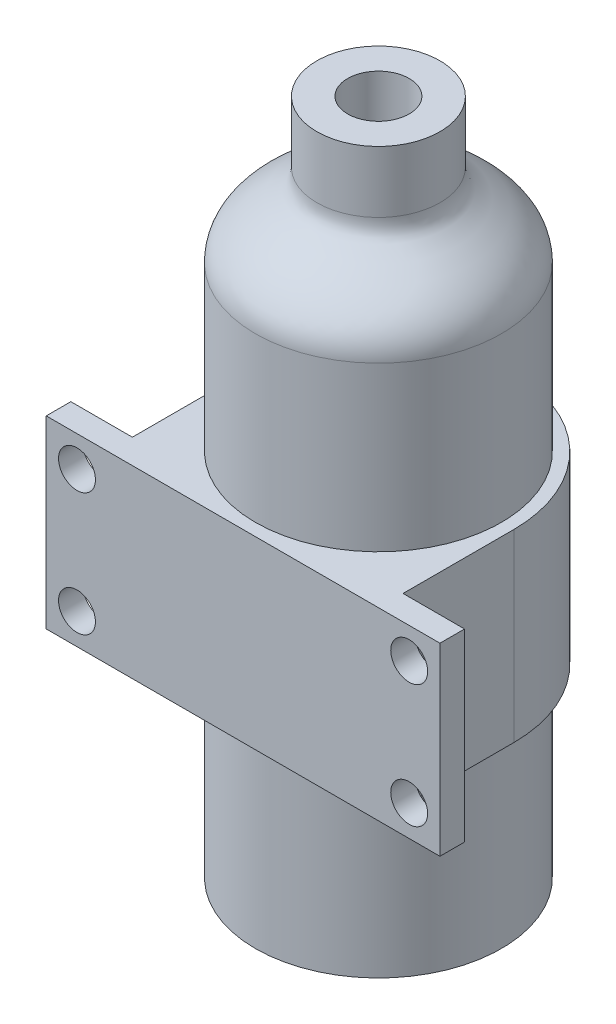
ISO-10303-21;
HEADER;
FILE_DESCRIPTION(('STEP AP214'),'2;1');
FILE_NAME('part.step','',(''),(''),'','','');
FILE_SCHEMA(('AUTOMOTIVE_DESIGN { 1 0 10303 214 1 1 1 1 }'));
ENDSEC;
DATA;
#1=APPLICATION_CONTEXT('core data for automotive mechanical design processes');
#2=APPLICATION_PROTOCOL_DEFINITION('international standard','automotive_design',2000,#1);
#3=PRODUCT_CONTEXT('',#1,'mechanical');
#4=PRODUCT('Part','Part','',(#3));
#5=PRODUCT_RELATED_PRODUCT_CATEGORY('part','',(#4));
#6=PRODUCT_DEFINITION_FORMATION('','',#4);
#7=PRODUCT_DEFINITION_CONTEXT('part definition',#1,'design');
#8=PRODUCT_DEFINITION('design','',#6,#7);
#9=PRODUCT_DEFINITION_SHAPE('','',#8);
#10=(LENGTH_UNIT() NAMED_UNIT(*) SI_UNIT(.MILLI.,.METRE.));
#11=(NAMED_UNIT(*) PLANE_ANGLE_UNIT() SI_UNIT($,.RADIAN.));
#12=(NAMED_UNIT(*) SI_UNIT($,.STERADIAN.) SOLID_ANGLE_UNIT());
#13=UNCERTAINTY_MEASURE_WITH_UNIT(LENGTH_MEASURE(1.E-05),#10,'distance_accuracy_value','');
#14=(GEOMETRIC_REPRESENTATION_CONTEXT(3) GLOBAL_UNCERTAINTY_ASSIGNED_CONTEXT((#13)) GLOBAL_UNIT_ASSIGNED_CONTEXT((#10,
#11,#12)) REPRESENTATION_CONTEXT('',''));
#15=CARTESIAN_POINT('',(0.,0.,0.));
#16=DIRECTION('',(0.,0.,1.));
#17=DIRECTION('',(1.,0.,0.));
#18=AXIS2_PLACEMENT_3D('',#15,#16,#17);
#19=CARTESIAN_POINT('',(10.,43.2783386948561,0.));
#20=CARTESIAN_POINT('',(10.,44.7124883333088,0.));
#21=CARTESIAN_POINT('',(8.86413325896539,46.2963021801879,0.));
#22=CARTESIAN_POINT('',(5.67921838337146,48.3380554247677,0.));
#23=CARTESIAN_POINT('',(5.,49.0049411055225,0.));
#24=CARTESIAN_POINT('',(5.,50.,0.));
#25=B_SPLINE_CURVE_WITH_KNOTS('',3,(#19,#20,#21,#22,#23,#24),.UNSPECIFIED.,.F.,.F.,(4,1,1,4),
(0.,0.573592634008202,0.80277958528906,1.),.UNSPECIFIED.);
#26=CARTESIAN_POINT('',(0.,0.,0.));
#27=DIRECTION('',(0.,-1.,0.));
#28=AXIS1_PLACEMENT('',#26,#27);
#29=SURFACE_OF_REVOLUTION('',#25,#28);
#30=CARTESIAN_POINT('',(0.,50.,0.));
#31=DIRECTION('',(0.,1.,0.));
#32=DIRECTION('',(0.,0.,1.));
#33=AXIS2_PLACEMENT_3D('',#30,#31,#32);
#34=CIRCLE('',#33,5.);
#35=CARTESIAN_POINT('',(0.,50.,5.));
#36=VERTEX_POINT('',#35);
#37=EDGE_CURVE('E240',#36,#36,#34,.T.);
#38=ORIENTED_EDGE('',*,*,#37,.F.);
#39=EDGE_LOOP('',(#38));
#40=FACE_BOUND('',#39,.T.);
#41=CARTESIAN_POINT('',(0.,43.2783386948561,0.));
#42=DIRECTION('',(0.,-1.,0.));
#43=DIRECTION('',(0.,0.,-1.));
#44=AXIS2_PLACEMENT_3D('',#41,#42,#43);
#45=CIRCLE('',#44,10.);
#46=CARTESIAN_POINT('',(0.,43.2783386948561,-10.));
#47=VERTEX_POINT('',#46);
#48=EDGE_CURVE('E50',#47,#47,#45,.T.);
#49=ORIENTED_EDGE('',*,*,#48,.F.);
#50=EDGE_LOOP('',(#49));
#51=FACE_BOUND('',#50,.T.);
#52=ADVANCED_FACE('F41',(#40,#51),#29,.F.);
#53=CARTESIAN_POINT('',(0.,0.,0.));
#54=DIRECTION('',(0.,-1.,0.));
#55=DIRECTION('',(0.,0.,-1.));
#56=AXIS2_PLACEMENT_3D('',#53,#54,#55);
#57=CYLINDRICAL_SURFACE('',#56,10.);
#58=CARTESIAN_POINT('',(0.,30.,0.));
#59=DIRECTION('',(0.,1.,0.));
#60=DIRECTION('',(0.,0.,1.));
#61=AXIS2_PLACEMENT_3D('',#58,#59,#60);
#62=CIRCLE('',#61,10.);
#63=CARTESIAN_POINT('',(0.,30.,10.));
#64=VERTEX_POINT('',#63);
#65=EDGE_CURVE('E11',#64,#64,#62,.F.);
#66=ORIENTED_EDGE('',*,*,#65,.F.);
#67=EDGE_LOOP('',(#66));
#68=FACE_BOUND('',#67,.T.);
#69=ORIENTED_EDGE('',*,*,#48,.T.);
#70=EDGE_LOOP('',(#69));
#71=FACE_BOUND('',#70,.T.);
#72=ADVANCED_FACE('F43',(#68,#71),#57,.T.);
#73=CARTESIAN_POINT('',(0.,55.,0.));
#74=DIRECTION('',(0.,-1.,0.));
#75=DIRECTION('',(0.,0.,-1.));
#76=AXIS2_PLACEMENT_3D('',#73,#74,#75);
#77=CYLINDRICAL_SURFACE('',#76,5.);
#78=CARTESIAN_POINT('',(0.,55.,0.));
#79=DIRECTION('',(0.,1.,0.));
#80=DIRECTION('',(0.,0.,1.));
#81=AXIS2_PLACEMENT_3D('',#78,#79,#80);
#82=CIRCLE('',#81,5.);
#83=CARTESIAN_POINT('',(0.,55.,5.));
#84=VERTEX_POINT('',#83);
#85=EDGE_CURVE('E235',#84,#84,#82,.T.);
#86=ORIENTED_EDGE('',*,*,#85,.F.);
#87=EDGE_LOOP('',(#86));
#88=FACE_BOUND('',#87,.T.);
#89=ORIENTED_EDGE('',*,*,#37,.T.);
#90=EDGE_LOOP('',(#89));
#91=FACE_BOUND('',#90,.T.);
#92=ADVANCED_FACE('F216',(#88,#91),#77,.T.);
#93=CARTESIAN_POINT('',(0.,55.,0.));
#94=DIRECTION('',(0.,1.,0.));
#95=DIRECTION('',(0.,0.,1.));
#96=AXIS2_PLACEMENT_3D('',#93,#94,#95);
#97=PLANE('',#96);
#98=CARTESIAN_POINT('',(0.,55.,0.));
#99=DIRECTION('',(0.,1.,0.));
#100=DIRECTION('',(0.,0.,1.));
#101=AXIS2_PLACEMENT_3D('',#98,#99,#100);
#102=CIRCLE('',#101,2.5);
#103=CARTESIAN_POINT('',(0.,55.,2.5));
#104=VERTEX_POINT('',#103);
#105=EDGE_CURVE('E304',#104,#104,#102,.T.);
#106=ORIENTED_EDGE('',*,*,#105,.F.);
#107=EDGE_LOOP('',(#106));
#108=FACE_BOUND('',#107,.T.);
#109=ORIENTED_EDGE('',*,*,#85,.T.);
#110=EDGE_LOOP('',(#109));
#111=FACE_BOUND('',#110,.T.);
#112=ADVANCED_FACE('F212',(#108,#111),#97,.T.);
#113=CARTESIAN_POINT('',(0.,45.,0.));
#114=DIRECTION('',(0.,1.,0.));
#115=DIRECTION('',(0.,0.,1.));
#116=AXIS2_PLACEMENT_3D('',#113,#114,#115);
#117=CYLINDRICAL_SURFACE('',#116,2.5);
#118=CARTESIAN_POINT('',(0.,45.,0.));
#119=DIRECTION('',(0.,1.,0.));
#120=DIRECTION('',(0.,0.,1.));
#121=AXIS2_PLACEMENT_3D('',#118,#119,#120);
#122=CIRCLE('',#121,2.5);
#123=CARTESIAN_POINT('',(0.,45.,2.5));
#124=VERTEX_POINT('',#123);
#125=EDGE_CURVE('E301',#124,#124,#122,.T.);
#126=ORIENTED_EDGE('',*,*,#125,.F.);
#127=EDGE_LOOP('',(#126));
#128=FACE_BOUND('',#127,.T.);
#129=ORIENTED_EDGE('',*,*,#105,.T.);
#130=EDGE_LOOP('',(#129));
#131=FACE_BOUND('',#130,.T.);
#132=ADVANCED_FACE('F209',(#128,#131),#117,.F.);
#133=CARTESIAN_POINT('',(10.,43.2783386948561,0.));
#134=CARTESIAN_POINT('',(10.,44.7124883333088,0.));
#135=CARTESIAN_POINT('',(8.86413325896539,46.2963021801879,0.));
#136=CARTESIAN_POINT('',(5.67921838337146,48.3380554247677,0.));
#137=CARTESIAN_POINT('',(5.,49.0049411055225,0.));
#138=CARTESIAN_POINT('',(5.,50.,0.));
#139=B_SPLINE_CURVE_WITH_KNOTS('',3,(#133,#134,#135,#136,#137,#138),.UNSPECIFIED.,.F.,.F.,(4,1,
1,4),(0.,0.573592634008202,0.80277958528906,1.),.UNSPECIFIED.);
#140=CARTESIAN_POINT('',(0.,0.,0.));
#141=DIRECTION('',(0.,-1.,0.));
#142=AXIS1_PLACEMENT('',#140,#141);
#143=SURFACE_OF_REVOLUTION('',#139,#142);
#144=OFFSET_SURFACE('',#143,2.,.F.);
#145=CARTESIAN_POINT('',(0.,43.2783386948561,0.));
#146=DIRECTION('',(0.,-1.,0.));
#147=DIRECTION('',(0.,0.,-1.));
#148=AXIS2_PLACEMENT_3D('',#145,#146,#147);
#149=CIRCLE('',#148,8.);
#150=CARTESIAN_POINT('',(0.,43.2783386948561,-8.));
#151=VERTEX_POINT('',#150);
#152=EDGE_CURVE('E170',#151,#151,#149,.T.);
#153=ORIENTED_EDGE('',*,*,#152,.T.);
#154=EDGE_LOOP('',(#153));
#155=FACE_BOUND('',#154,.T.);
#156=CARTESIAN_POINT('',(0.,46.8009969156272,0.));
#157=DIRECTION('',(0.,-1.,0.));
#158=DIRECTION('',(0.,0.,-1.));
#159=AXIS2_PLACEMENT_3D('',#156,#157,#158);
#160=CIRCLE('',#159,4.50000000000001);
#161=CARTESIAN_POINT('',(0.,46.8009969156272,-4.50000000000001));
#162=VERTEX_POINT('',#161);
#163=EDGE_CURVE('E173',#162,#162,#160,.T.);
#164=ORIENTED_EDGE('',*,*,#163,.F.);
#165=EDGE_LOOP('',(#164));
#166=FACE_BOUND('',#165,.T.);
#167=ADVANCED_FACE('F194',(#155,#166),#144,.T.);
#168=CARTESIAN_POINT('',(0.,0.,0.));
#169=DIRECTION('',(0.,-1.,0.));
#170=DIRECTION('',(0.,0.,-1.));
#171=AXIS2_PLACEMENT_3D('',#168,#169,#170);
#172=CYLINDRICAL_SURFACE('',#171,8.);
#173=ORIENTED_EDGE('',*,*,#152,.F.);
#174=EDGE_LOOP('',(#173));
#175=FACE_BOUND('',#174,.T.);
#176=CARTESIAN_POINT('',(0.,2.,0.));
#177=DIRECTION('',(0.,-1.,0.));
#178=DIRECTION('',(0.,0.,-1.));
#179=AXIS2_PLACEMENT_3D('',#176,#177,#178);
#180=CIRCLE('',#179,8.);
#181=CARTESIAN_POINT('',(0.,2.,-8.));
#182=VERTEX_POINT('',#181);
#183=EDGE_CURVE('E174',#182,#182,#180,.T.);
#184=ORIENTED_EDGE('',*,*,#183,.T.);
#185=EDGE_LOOP('',(#184));
#186=FACE_BOUND('',#185,.T.);
#187=ADVANCED_FACE('F196',(#175,#186),#172,.F.);
#188=CARTESIAN_POINT('',(10.,2.,0.));
#189=DIRECTION('',(0.,-1.,0.));
#190=DIRECTION('',(0.,0.,-1.));
#191=AXIS2_PLACEMENT_3D('',#188,#189,#190);
#192=PLANE('',#191);
#193=ORIENTED_EDGE('',*,*,#183,.F.);
#194=EDGE_LOOP('',(#193));
#195=FACE_BOUND('',#194,.T.);
#196=ADVANCED_FACE('F199',(#195),#192,.F.);
#197=CARTESIAN_POINT('',(0.,45.,0.));
#198=DIRECTION('',(0.,1.,0.));
#199=DIRECTION('',(0.,0.,1.));
#200=AXIS2_PLACEMENT_3D('',#197,#198,#199);
#201=CYLINDRICAL_SURFACE('',#200,4.5);
#202=ORIENTED_EDGE('',*,*,#163,.T.);
#203=EDGE_LOOP('',(#202));
#204=FACE_BOUND('',#203,.T.);
#205=CARTESIAN_POINT('',(0.,45.,0.));
#206=DIRECTION('',(0.,1.,0.));
#207=DIRECTION('',(0.,0.,1.));
#208=AXIS2_PLACEMENT_3D('',#205,#206,#207);
#209=CIRCLE('',#208,4.5);
#210=CARTESIAN_POINT('',(0.,45.,4.5));
#211=VERTEX_POINT('',#210);
#212=EDGE_CURVE('E177',#211,#211,#209,.T.);
#213=ORIENTED_EDGE('',*,*,#212,.T.);
#214=EDGE_LOOP('',(#213));
#215=FACE_BOUND('',#214,.T.);
#216=ADVANCED_FACE('F203',(#204,#215),#201,.T.);
#217=CARTESIAN_POINT('',(0.,45.,0.));
#218=DIRECTION('',(0.,1.,0.));
#219=DIRECTION('',(0.,0.,1.));
#220=AXIS2_PLACEMENT_3D('',#217,#218,#219);
#221=PLANE('',#220);
#222=ORIENTED_EDGE('',*,*,#125,.T.);
#223=EDGE_LOOP('',(#222));
#224=FACE_BOUND('',#223,.T.);
#225=ORIENTED_EDGE('',*,*,#212,.F.);
#226=EDGE_LOOP('',(#225));
#227=FACE_BOUND('',#226,.T.);
#228=ADVANCED_FACE('F207',(#224,#227),#221,.F.);
#229=CARTESIAN_POINT('',(0.,30.,0.));
#230=DIRECTION('',(0.,1.,0.));
#231=DIRECTION('',(0.,0.,1.));
#232=AXIS2_PLACEMENT_3D('',#229,#230,#231);
#233=PLANE('',#232);
#234=ORIENTED_EDGE('',*,*,#65,.T.);
#235=EDGE_LOOP('',(#234));
#236=FACE_BOUND('',#235,.T.);
#237=CARTESIAN_POINT('',(0.,30.,0.));
#238=DIRECTION('',(0.,1.,0.));
#239=DIRECTION('',(0.,0.,1.));
#240=AXIS2_PLACEMENT_3D('',#237,#238,#239);
#241=CIRCLE('',#240,11.);
#242=CARTESIAN_POINT('',(11.,30.,0.));
#243=VERTEX_POINT('',#242);
#244=CARTESIAN_POINT('',(-11.,30.,0.));
#245=VERTEX_POINT('',#244);
#246=EDGE_CURVE('E154',#243,#245,#241,.T.);
#247=ORIENTED_EDGE('',*,*,#246,.T.);
#248=DIRECTION('',(0.,0.,1.));
#249=VECTOR('',#248,1.);
#250=CARTESIAN_POINT('',(-11.,30.,0.));
#251=LINE('',#250,#249);
#252=CARTESIAN_POINT('',(-11.,30.,9.));
#253=VERTEX_POINT('',#252);
#254=EDGE_CURVE('E102',#245,#253,#251,.T.);
#255=ORIENTED_EDGE('',*,*,#254,.T.);
#256=DIRECTION('',(-1.,0.,0.));
#257=VECTOR('',#256,1.);
#258=CARTESIAN_POINT('',(-11.,30.,9.));
#259=LINE('',#258,#257);
#260=CARTESIAN_POINT('',(-16.,30.,9.));
#261=VERTEX_POINT('',#260);
#262=EDGE_CURVE('E258',#253,#261,#259,.T.);
#263=ORIENTED_EDGE('',*,*,#262,.T.);
#264=DIRECTION('',(0.,0.,1.));
#265=VECTOR('',#264,1.);
#266=CARTESIAN_POINT('',(-16.,30.,9.));
#267=LINE('',#266,#265);
#268=CARTESIAN_POINT('',(-16.,30.,11.));
#269=VERTEX_POINT('',#268);
#270=EDGE_CURVE('E265',#261,#269,#267,.T.);
#271=ORIENTED_EDGE('',*,*,#270,.T.);
#272=DIRECTION('',(1.,0.,0.));
#273=VECTOR('',#272,1.);
#274=CARTESIAN_POINT('',(-16.,30.,11.));
#275=LINE('',#274,#273);
#276=CARTESIAN_POINT('',(16.,30.,11.));
#277=VERTEX_POINT('',#276);
#278=EDGE_CURVE('E121',#269,#277,#275,.T.);
#279=ORIENTED_EDGE('',*,*,#278,.T.);
#280=DIRECTION('',(0.,0.,-1.));
#281=VECTOR('',#280,1.);
#282=CARTESIAN_POINT('',(16.,30.,11.));
#283=LINE('',#282,#281);
#284=CARTESIAN_POINT('',(16.,30.,9.));
#285=VERTEX_POINT('',#284);
#286=EDGE_CURVE('E115',#277,#285,#283,.T.);
#287=ORIENTED_EDGE('',*,*,#286,.T.);
#288=DIRECTION('',(-1.,0.,0.));
#289=VECTOR('',#288,1.);
#290=CARTESIAN_POINT('',(16.,30.,9.));
#291=LINE('',#290,#289);
#292=CARTESIAN_POINT('',(11.,30.,9.));
#293=VERTEX_POINT('',#292);
#294=EDGE_CURVE('E119',#285,#293,#291,.T.);
#295=ORIENTED_EDGE('',*,*,#294,.T.);
#296=DIRECTION('',(0.,0.,-1.));
#297=VECTOR('',#296,1.);
#298=CARTESIAN_POINT('',(11.,30.,9.));
#299=LINE('',#298,#297);
#300=EDGE_CURVE('E58',#293,#243,#299,.T.);
#301=ORIENTED_EDGE('',*,*,#300,.T.);
#302=EDGE_LOOP('',(#247,#255,#263,#271,#279,#287,#295,#301));
#303=FACE_BOUND('',#302,.T.);
#304=ADVANCED_FACE('F117',(#236,#303),#233,.T.);
#305=CARTESIAN_POINT('',(0.,15.,0.));
#306=DIRECTION('',(0.,1.,0.));
#307=DIRECTION('',(0.,0.,1.));
#308=AXIS2_PLACEMENT_3D('',#305,#306,#307);
#309=PLANE('',#308);
#310=CARTESIAN_POINT('',(0.,15.,0.));
#311=DIRECTION('',(0.,1.,0.));
#312=DIRECTION('',(0.,0.,1.));
#313=AXIS2_PLACEMENT_3D('',#310,#311,#312);
#314=CIRCLE('',#313,10.);
#315=CARTESIAN_POINT('',(0.,15.,10.));
#316=VERTEX_POINT('',#315);
#317=EDGE_CURVE('E169',#316,#316,#314,.F.);
#318=ORIENTED_EDGE('',*,*,#317,.F.);
#319=EDGE_LOOP('',(#318));
#320=FACE_BOUND('',#319,.T.);
#321=CARTESIAN_POINT('',(0.,15.,0.));
#322=DIRECTION('',(0.,1.,0.));
#323=DIRECTION('',(0.,0.,1.));
#324=AXIS2_PLACEMENT_3D('',#321,#322,#323);
#325=CIRCLE('',#324,11.);
#326=CARTESIAN_POINT('',(11.,15.,0.));
#327=VERTEX_POINT('',#326);
#328=CARTESIAN_POINT('',(-11.,15.,0.));
#329=VERTEX_POINT('',#328);
#330=EDGE_CURVE('E139',#327,#329,#325,.T.);
#331=ORIENTED_EDGE('',*,*,#330,.F.);
#332=DIRECTION('',(0.,0.,-1.));
#333=VECTOR('',#332,1.);
#334=CARTESIAN_POINT('',(11.,15.,9.));
#335=LINE('',#334,#333);
#336=CARTESIAN_POINT('',(11.,15.,9.));
#337=VERTEX_POINT('',#336);
#338=EDGE_CURVE('E93',#337,#327,#335,.T.);
#339=ORIENTED_EDGE('',*,*,#338,.F.);
#340=DIRECTION('',(-1.,0.,0.));
#341=VECTOR('',#340,1.);
#342=CARTESIAN_POINT('',(16.,15.,9.));
#343=LINE('',#342,#341);
#344=CARTESIAN_POINT('',(16.,15.,9.));
#345=VERTEX_POINT('',#344);
#346=EDGE_CURVE('E87',#345,#337,#343,.T.);
#347=ORIENTED_EDGE('',*,*,#346,.F.);
#348=DIRECTION('',(0.,0.,-1.));
#349=VECTOR('',#348,1.);
#350=CARTESIAN_POINT('',(16.,15.,11.));
#351=LINE('',#350,#349);
#352=CARTESIAN_POINT('',(16.,15.,11.));
#353=VERTEX_POINT('',#352);
#354=EDGE_CURVE('E129',#353,#345,#351,.T.);
#355=ORIENTED_EDGE('',*,*,#354,.F.);
#356=DIRECTION('',(1.,0.,0.));
#357=VECTOR('',#356,1.);
#358=CARTESIAN_POINT('',(-16.,15.,11.));
#359=LINE('',#358,#357);
#360=CARTESIAN_POINT('',(-16.,15.,11.));
#361=VERTEX_POINT('',#360);
#362=EDGE_CURVE('E149',#361,#353,#359,.T.);
#363=ORIENTED_EDGE('',*,*,#362,.F.);
#364=DIRECTION('',(0.,0.,1.));
#365=VECTOR('',#364,1.);
#366=CARTESIAN_POINT('',(-16.,15.,9.));
#367=LINE('',#366,#365);
#368=CARTESIAN_POINT('',(-16.,15.,9.));
#369=VERTEX_POINT('',#368);
#370=EDGE_CURVE('E147',#369,#361,#367,.T.);
#371=ORIENTED_EDGE('',*,*,#370,.F.);
#372=DIRECTION('',(-1.,0.,0.));
#373=VECTOR('',#372,1.);
#374=CARTESIAN_POINT('',(-11.,15.,9.));
#375=LINE('',#374,#373);
#376=CARTESIAN_POINT('',(-11.,15.,9.));
#377=VERTEX_POINT('',#376);
#378=EDGE_CURVE('E145',#377,#369,#375,.T.);
#379=ORIENTED_EDGE('',*,*,#378,.F.);
#380=DIRECTION('',(0.,0.,1.));
#381=VECTOR('',#380,1.);
#382=CARTESIAN_POINT('',(-11.,15.,0.));
#383=LINE('',#382,#381);
#384=EDGE_CURVE('E142',#329,#377,#383,.T.);
#385=ORIENTED_EDGE('',*,*,#384,.F.);
#386=EDGE_LOOP('',(#331,#339,#347,#355,#363,#371,#379,#385));
#387=FACE_BOUND('',#386,.T.);
#388=ADVANCED_FACE('F247',(#320,#387),#309,.F.);
#389=CARTESIAN_POINT('',(0.,30.,0.));
#390=DIRECTION('',(0.,-1.,0.));
#391=DIRECTION('',(0.,0.,-1.));
#392=AXIS2_PLACEMENT_3D('',#389,#390,#391);
#393=CYLINDRICAL_SURFACE('',#392,11.);
#394=ORIENTED_EDGE('',*,*,#330,.T.);
#395=DIRECTION('',(0.,-1.,0.));
#396=VECTOR('',#395,1.);
#397=CARTESIAN_POINT('',(-11.,30.,0.));
#398=LINE('',#397,#396);
#399=EDGE_CURVE('E167',#245,#329,#398,.T.);
#400=ORIENTED_EDGE('',*,*,#399,.F.);
#401=ORIENTED_EDGE('',*,*,#246,.F.);
#402=DIRECTION('',(0.,-1.,0.));
#403=VECTOR('',#402,1.);
#404=CARTESIAN_POINT('',(11.,30.,0.));
#405=LINE('',#404,#403);
#406=EDGE_CURVE('E135',#243,#327,#405,.T.);
#407=ORIENTED_EDGE('',*,*,#406,.T.);
#408=EDGE_LOOP('',(#394,#400,#401,#407));
#409=FACE_BOUND('',#408,.T.);
#410=ADVANCED_FACE('F250',(#409),#393,.T.);
#411=CARTESIAN_POINT('',(-11.,30.,0.));
#412=DIRECTION('',(1.,0.,0.));
#413=DIRECTION('',(0.,0.,-1.));
#414=AXIS2_PLACEMENT_3D('',#411,#412,#413);
#415=PLANE('',#414);
#416=ORIENTED_EDGE('',*,*,#384,.T.);
#417=DIRECTION('',(0.,-1.,0.));
#418=VECTOR('',#417,1.);
#419=CARTESIAN_POINT('',(-11.,30.,9.));
#420=LINE('',#419,#418);
#421=EDGE_CURVE('E164',#253,#377,#420,.T.);
#422=ORIENTED_EDGE('',*,*,#421,.F.);
#423=ORIENTED_EDGE('',*,*,#254,.F.);
#424=ORIENTED_EDGE('',*,*,#399,.T.);
#425=EDGE_LOOP('',(#416,#422,#423,#424));
#426=FACE_BOUND('',#425,.T.);
#427=ADVANCED_FACE('F278',(#426),#415,.F.);
#428=CARTESIAN_POINT('',(-11.,30.,9.));
#429=DIRECTION('',(0.,0.,1.));
#430=DIRECTION('',(1.,0.,0.));
#431=AXIS2_PLACEMENT_3D('',#428,#429,#430);
#432=PLANE('',#431);
#433=CARTESIAN_POINT('',(-13.5,27.5,9.));
#434=DIRECTION('',(0.,0.,-1.));
#435=DIRECTION('',(-1.,0.,0.));
#436=AXIS2_PLACEMENT_3D('',#433,#434,#435);
#437=CIRCLE('',#436,1.5);
#438=CARTESIAN_POINT('',(-15.,27.5,9.));
#439=VERTEX_POINT('',#438);
#440=EDGE_CURVE('E456',#439,#439,#437,.T.);
#441=ORIENTED_EDGE('',*,*,#440,.F.);
#442=EDGE_LOOP('',(#441));
#443=FACE_BOUND('',#442,.T.);
#444=CARTESIAN_POINT('',(-13.5,17.5,9.));
#445=DIRECTION('',(0.,0.,-1.));
#446=DIRECTION('',(-1.,0.,0.));
#447=AXIS2_PLACEMENT_3D('',#444,#445,#446);
#448=CIRCLE('',#447,1.5);
#449=CARTESIAN_POINT('',(-15.,17.5,9.));
#450=VERTEX_POINT('',#449);
#451=EDGE_CURVE('E460',#450,#450,#448,.T.);
#452=ORIENTED_EDGE('',*,*,#451,.F.);
#453=EDGE_LOOP('',(#452));
#454=FACE_BOUND('',#453,.T.);
#455=ORIENTED_EDGE('',*,*,#378,.T.);
#456=DIRECTION('',(0.,-1.,0.));
#457=VECTOR('',#456,1.);
#458=CARTESIAN_POINT('',(-16.,30.,9.));
#459=LINE('',#458,#457);
#460=EDGE_CURVE('E161',#261,#369,#459,.T.);
#461=ORIENTED_EDGE('',*,*,#460,.F.);
#462=ORIENTED_EDGE('',*,*,#262,.F.);
#463=ORIENTED_EDGE('',*,*,#421,.T.);
#464=EDGE_LOOP('',(#455,#461,#462,#463));
#465=FACE_BOUND('',#464,.T.);
#466=ADVANCED_FACE('F277',(#443,#454,#465),#432,.F.);
#467=CARTESIAN_POINT('',(-16.,30.,9.));
#468=DIRECTION('',(1.,0.,0.));
#469=DIRECTION('',(0.,0.,-1.));
#470=AXIS2_PLACEMENT_3D('',#467,#468,#469);
#471=PLANE('',#470);
#472=ORIENTED_EDGE('',*,*,#370,.T.);
#473=DIRECTION('',(0.,-1.,0.));
#474=VECTOR('',#473,1.);
#475=CARTESIAN_POINT('',(-16.,30.,11.));
#476=LINE('',#475,#474);
#477=EDGE_CURVE('E158',#269,#361,#476,.T.);
#478=ORIENTED_EDGE('',*,*,#477,.F.);
#479=ORIENTED_EDGE('',*,*,#270,.F.);
#480=ORIENTED_EDGE('',*,*,#460,.T.);
#481=EDGE_LOOP('',(#472,#478,#479,#480));
#482=FACE_BOUND('',#481,.T.);
#483=ADVANCED_FACE('F271',(#482),#471,.F.);
#484=CARTESIAN_POINT('',(-16.,30.,11.));
#485=DIRECTION('',(0.,0.,-1.));
#486=DIRECTION('',(-1.,0.,0.));
#487=AXIS2_PLACEMENT_3D('',#484,#485,#486);
#488=PLANE('',#487);
#489=CARTESIAN_POINT('',(-13.5,27.5,11.));
#490=DIRECTION('',(0.,0.,-1.));
#491=DIRECTION('',(-1.,0.,0.));
#492=AXIS2_PLACEMENT_3D('',#489,#490,#491);
#493=CIRCLE('',#492,1.5);
#494=CARTESIAN_POINT('',(-15.,27.5,11.));
#495=VERTEX_POINT('',#494);
#496=EDGE_CURVE('E453',#495,#495,#493,.T.);
#497=ORIENTED_EDGE('',*,*,#496,.T.);
#498=EDGE_LOOP('',(#497));
#499=FACE_BOUND('',#498,.T.);
#500=CARTESIAN_POINT('',(-13.5,17.5,11.));
#501=DIRECTION('',(0.,0.,-1.));
#502=DIRECTION('',(-1.,0.,0.));
#503=AXIS2_PLACEMENT_3D('',#500,#501,#502);
#504=CIRCLE('',#503,1.5);
#505=CARTESIAN_POINT('',(-15.,17.5,11.));
#506=VERTEX_POINT('',#505);
#507=EDGE_CURVE('E457',#506,#506,#504,.T.);
#508=ORIENTED_EDGE('',*,*,#507,.T.);
#509=EDGE_LOOP('',(#508));
#510=FACE_BOUND('',#509,.T.);
#511=CARTESIAN_POINT('',(13.5,17.5,11.));
#512=DIRECTION('',(0.,0.,-1.));
#513=DIRECTION('',(-1.,0.,0.));
#514=AXIS2_PLACEMENT_3D('',#511,#512,#513);
#515=CIRCLE('',#514,1.5);
#516=CARTESIAN_POINT('',(12.,17.5,11.));
#517=VERTEX_POINT('',#516);
#518=EDGE_CURVE('E472',#517,#517,#515,.T.);
#519=ORIENTED_EDGE('',*,*,#518,.T.);
#520=EDGE_LOOP('',(#519));
#521=FACE_BOUND('',#520,.T.);
#522=CARTESIAN_POINT('',(13.5,27.5,11.));
#523=DIRECTION('',(0.,0.,-1.));
#524=DIRECTION('',(-1.,0.,0.));
#525=AXIS2_PLACEMENT_3D('',#522,#523,#524);
#526=CIRCLE('',#525,1.5);
#527=CARTESIAN_POINT('',(12.,27.5,11.));
#528=VERTEX_POINT('',#527);
#529=EDGE_CURVE('E143',#528,#528,#526,.T.);
#530=ORIENTED_EDGE('',*,*,#529,.T.);
#531=EDGE_LOOP('',(#530));
#532=FACE_BOUND('',#531,.T.);
#533=ORIENTED_EDGE('',*,*,#362,.T.);
#534=DIRECTION('',(0.,-1.,0.));
#535=VECTOR('',#534,1.);
#536=CARTESIAN_POINT('',(16.,30.,11.));
#537=LINE('',#536,#535);
#538=EDGE_CURVE('E130',#277,#353,#537,.T.);
#539=ORIENTED_EDGE('',*,*,#538,.F.);
#540=ORIENTED_EDGE('',*,*,#278,.F.);
#541=ORIENTED_EDGE('',*,*,#477,.T.);
#542=EDGE_LOOP('',(#533,#539,#540,#541));
#543=FACE_BOUND('',#542,.T.);
#544=ADVANCED_FACE('F275',(#499,#510,#521,#532,#543),#488,.F.);
#545=CARTESIAN_POINT('',(16.,30.,11.));
#546=DIRECTION('',(-1.,0.,0.));
#547=DIRECTION('',(0.,0.,1.));
#548=AXIS2_PLACEMENT_3D('',#545,#546,#547);
#549=PLANE('',#548);
#550=ORIENTED_EDGE('',*,*,#354,.T.);
#551=DIRECTION('',(0.,-1.,0.));
#552=VECTOR('',#551,1.);
#553=CARTESIAN_POINT('',(16.,30.,9.));
#554=LINE('',#553,#552);
#555=EDGE_CURVE('E126',#285,#345,#554,.T.);
#556=ORIENTED_EDGE('',*,*,#555,.F.);
#557=ORIENTED_EDGE('',*,*,#286,.F.);
#558=ORIENTED_EDGE('',*,*,#538,.T.);
#559=EDGE_LOOP('',(#550,#556,#557,#558));
#560=FACE_BOUND('',#559,.T.);
#561=ADVANCED_FACE('F127',(#560),#549,.F.);
#562=CARTESIAN_POINT('',(16.,30.,9.));
#563=DIRECTION('',(0.,0.,1.));
#564=DIRECTION('',(1.,0.,0.));
#565=AXIS2_PLACEMENT_3D('',#562,#563,#564);
#566=PLANE('',#565);
#567=CARTESIAN_POINT('',(13.5,17.5,9.));
#568=DIRECTION('',(0.,0.,-1.));
#569=DIRECTION('',(-1.,0.,0.));
#570=AXIS2_PLACEMENT_3D('',#567,#568,#569);
#571=CIRCLE('',#570,1.5);
#572=CARTESIAN_POINT('',(12.,17.5,9.));
#573=VERTEX_POINT('',#572);
#574=EDGE_CURVE('E468',#573,#573,#571,.T.);
#575=ORIENTED_EDGE('',*,*,#574,.F.);
#576=EDGE_LOOP('',(#575));
#577=FACE_BOUND('',#576,.T.);
#578=CARTESIAN_POINT('',(13.5,27.5,9.));
#579=DIRECTION('',(0.,0.,-1.));
#580=DIRECTION('',(-1.,0.,0.));
#581=AXIS2_PLACEMENT_3D('',#578,#579,#580);
#582=CIRCLE('',#581,1.5);
#583=CARTESIAN_POINT('',(12.,27.5,9.));
#584=VERTEX_POINT('',#583);
#585=EDGE_CURVE('E261',#584,#584,#582,.T.);
#586=ORIENTED_EDGE('',*,*,#585,.F.);
#587=EDGE_LOOP('',(#586));
#588=FACE_BOUND('',#587,.T.);
#589=ORIENTED_EDGE('',*,*,#346,.T.);
#590=DIRECTION('',(0.,-1.,0.));
#591=VECTOR('',#590,1.);
#592=CARTESIAN_POINT('',(11.,30.,9.));
#593=LINE('',#592,#591);
#594=EDGE_CURVE('E131',#293,#337,#593,.T.);
#595=ORIENTED_EDGE('',*,*,#594,.F.);
#596=ORIENTED_EDGE('',*,*,#294,.F.);
#597=ORIENTED_EDGE('',*,*,#555,.T.);
#598=EDGE_LOOP('',(#589,#595,#596,#597));
#599=FACE_BOUND('',#598,.T.);
#600=ADVANCED_FACE('F133',(#577,#588,#599),#566,.F.);
#601=CARTESIAN_POINT('',(11.,30.,9.));
#602=DIRECTION('',(-1.,0.,0.));
#603=DIRECTION('',(0.,0.,1.));
#604=AXIS2_PLACEMENT_3D('',#601,#602,#603);
#605=PLANE('',#604);
#606=ORIENTED_EDGE('',*,*,#338,.T.);
#607=ORIENTED_EDGE('',*,*,#406,.F.);
#608=ORIENTED_EDGE('',*,*,#300,.F.);
#609=ORIENTED_EDGE('',*,*,#594,.T.);
#610=EDGE_LOOP('',(#606,#607,#608,#609));
#611=FACE_BOUND('',#610,.T.);
#612=ADVANCED_FACE('F223',(#611),#605,.F.);
#613=CARTESIAN_POINT('',(10.,0.,0.));
#614=DIRECTION('',(0.,-1.,0.));
#615=DIRECTION('',(0.,0.,-1.));
#616=AXIS2_PLACEMENT_3D('',#613,#614,#615);
#617=PLANE('',#616);
#618=CARTESIAN_POINT('',(0.,0.,0.));
#619=DIRECTION('',(0.,-1.,0.));
#620=DIRECTION('',(0.,0.,-1.));
#621=AXIS2_PLACEMENT_3D('',#618,#619,#620);
#622=CIRCLE('',#621,10.);
#623=CARTESIAN_POINT('',(0.,0.,-10.));
#624=VERTEX_POINT('',#623);
#625=EDGE_CURVE('E234',#624,#624,#622,.T.);
#626=ORIENTED_EDGE('',*,*,#625,.T.);
#627=EDGE_LOOP('',(#626));
#628=FACE_BOUND('',#627,.T.);
#629=ADVANCED_FACE('F220',(#628),#617,.T.);
#630=ORIENTED_EDGE('',*,*,#625,.F.);
#631=EDGE_LOOP('',(#630));
#632=FACE_BOUND('',#631,.T.);
#633=ORIENTED_EDGE('',*,*,#317,.T.);
#634=EDGE_LOOP('',(#633));
#635=FACE_BOUND('',#634,.T.);
#636=ADVANCED_FACE('F222',(#632,#635),#57,.T.);
#637=CARTESIAN_POINT('',(13.5,27.5,11.));
#638=DIRECTION('',(0.,0.,-1.));
#639=DIRECTION('',(-1.,0.,0.));
#640=AXIS2_PLACEMENT_3D('',#637,#638,#639);
#641=CYLINDRICAL_SURFACE('',#640,1.5);
#642=ORIENTED_EDGE('',*,*,#529,.F.);
#643=EDGE_LOOP('',(#642));
#644=FACE_BOUND('',#643,.T.);
#645=ORIENTED_EDGE('',*,*,#585,.T.);
#646=EDGE_LOOP('',(#645));
#647=FACE_BOUND('',#646,.T.);
#648=ADVANCED_FACE('F228',(#644,#647),#641,.F.);
#649=CARTESIAN_POINT('',(13.5,17.5,11.));
#650=DIRECTION('',(0.,0.,-1.));
#651=DIRECTION('',(-1.,0.,0.));
#652=AXIS2_PLACEMENT_3D('',#649,#650,#651);
#653=CYLINDRICAL_SURFACE('',#652,1.5);
#654=ORIENTED_EDGE('',*,*,#518,.F.);
#655=EDGE_LOOP('',(#654));
#656=FACE_BOUND('',#655,.T.);
#657=ORIENTED_EDGE('',*,*,#574,.T.);
#658=EDGE_LOOP('',(#657));
#659=FACE_BOUND('',#658,.T.);
#660=ADVANCED_FACE('F417',(#656,#659),#653,.F.);
#661=CARTESIAN_POINT('',(-13.5,17.5,11.));
#662=DIRECTION('',(0.,0.,-1.));
#663=DIRECTION('',(-1.,0.,0.));
#664=AXIS2_PLACEMENT_3D('',#661,#662,#663);
#665=CYLINDRICAL_SURFACE('',#664,1.5);
#666=ORIENTED_EDGE('',*,*,#507,.F.);
#667=EDGE_LOOP('',(#666));
#668=FACE_BOUND('',#667,.T.);
#669=ORIENTED_EDGE('',*,*,#451,.T.);
#670=EDGE_LOOP('',(#669));
#671=FACE_BOUND('',#670,.T.);
#672=ADVANCED_FACE('F427',(#668,#671),#665,.F.);
#673=CARTESIAN_POINT('',(-13.5,27.5,11.));
#674=DIRECTION('',(0.,0.,-1.));
#675=DIRECTION('',(-1.,0.,0.));
#676=AXIS2_PLACEMENT_3D('',#673,#674,#675);
#677=CYLINDRICAL_SURFACE('',#676,1.5);
#678=ORIENTED_EDGE('',*,*,#496,.F.);
#679=EDGE_LOOP('',(#678));
#680=FACE_BOUND('',#679,.T.);
#681=ORIENTED_EDGE('',*,*,#440,.T.);
#682=EDGE_LOOP('',(#681));
#683=FACE_BOUND('',#682,.T.);
#684=ADVANCED_FACE('F437',(#680,#683),#677,.F.);
#685=CLOSED_SHELL('',(#52,#72,#92,#112,#132,#167,#187,#196,#216,#228,#304,#388,#410,#427,#466,
#483,#544,#561,#600,#612,#629,#636,#648,#660,#672,#684));
#686=MANIFOLD_SOLID_BREP('B2',#685);
#687=ADVANCED_BREP_SHAPE_REPRESENTATION('',(#18,#686),#14);
#688=SHAPE_DEFINITION_REPRESENTATION(#9,#687);
ENDSEC;
END-ISO-10303-21;
